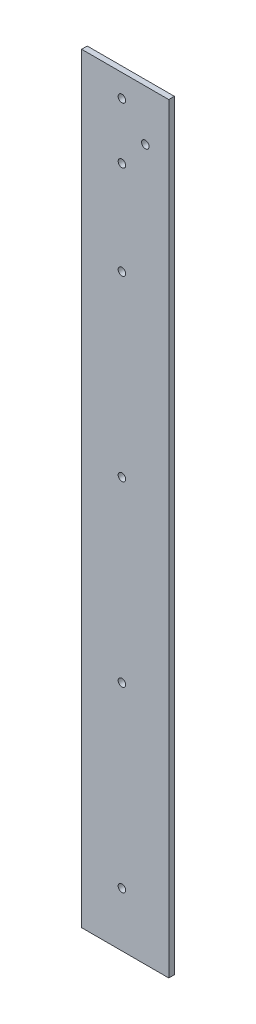
ISO-10303-21;
HEADER;
FILE_DESCRIPTION(('STEP AP214'),'2;1');
FILE_NAME('part.step','',(''),(''),'','','');
FILE_SCHEMA(('AUTOMOTIVE_DESIGN { 1 0 10303 214 1 1 1 1 }'));
ENDSEC;
DATA;
#1=APPLICATION_CONTEXT('core data for automotive mechanical design processes');
#2=APPLICATION_PROTOCOL_DEFINITION('international standard','automotive_design',2000,#1);
#3=PRODUCT_CONTEXT('',#1,'mechanical');
#4=PRODUCT('Part','Part','',(#3));
#5=PRODUCT_RELATED_PRODUCT_CATEGORY('part','',(#4));
#6=PRODUCT_DEFINITION_FORMATION('','',#4);
#7=PRODUCT_DEFINITION_CONTEXT('part definition',#1,'design');
#8=PRODUCT_DEFINITION('design','',#6,#7);
#9=PRODUCT_DEFINITION_SHAPE('','',#8);
#10=(LENGTH_UNIT() NAMED_UNIT(*) SI_UNIT(.MILLI.,.METRE.));
#11=(NAMED_UNIT(*) PLANE_ANGLE_UNIT() SI_UNIT($,.RADIAN.));
#12=(NAMED_UNIT(*) SI_UNIT($,.STERADIAN.) SOLID_ANGLE_UNIT());
#13=UNCERTAINTY_MEASURE_WITH_UNIT(LENGTH_MEASURE(1.E-05),#10,'distance_accuracy_value','');
#14=(GEOMETRIC_REPRESENTATION_CONTEXT(3) GLOBAL_UNCERTAINTY_ASSIGNED_CONTEXT((#13)) GLOBAL_UNIT_ASSIGNED_CONTEXT((#10,
#11,#12)) REPRESENTATION_CONTEXT('',''));
#15=CARTESIAN_POINT('',(0.,0.,0.));
#16=DIRECTION('',(0.,0.,1.));
#17=DIRECTION('',(1.,0.,0.));
#18=AXIS2_PLACEMENT_3D('',#15,#16,#17);
#19=CARTESIAN_POINT('',(0.,0.,3.));
#20=DIRECTION('',(0.,0.,1.));
#21=DIRECTION('',(1.,0.,0.));
#22=AXIS2_PLACEMENT_3D('',#19,#20,#21);
#23=PLANE('',#22);
#24=CARTESIAN_POINT('',(-1.19205738297437,-78.7210286915478,3.));
#25=DIRECTION('',(0.,0.,1.));
#26=DIRECTION('',(1.,0.,0.));
#27=AXIS2_PLACEMENT_3D('',#24,#25,#26);
#28=CIRCLE('',#27,2.0000000000209);
#29=CARTESIAN_POINT('',(0.807942617046531,-78.7210286915478,3.));
#30=VERTEX_POINT('',#29);
#31=EDGE_CURVE('E139',#30,#30,#28,.T.);
#32=ORIENTED_EDGE('',*,*,#31,.F.);
#33=EDGE_LOOP('',(#32));
#34=FACE_BOUND('',#33,.T.);
#35=CARTESIAN_POINT('',(-1.19205738297238,111.278971308452,3.));
#36=DIRECTION('',(0.,0.,1.));
#37=DIRECTION('',(1.,0.,0.));
#38=AXIS2_PLACEMENT_3D('',#35,#36,#37);
#39=CIRCLE('',#38,2.0000000000209);
#40=CARTESIAN_POINT('',(0.807942617048523,111.278971308452,3.));
#41=VERTEX_POINT('',#40);
#42=EDGE_CURVE('E127',#41,#41,#39,.T.);
#43=ORIENTED_EDGE('',*,*,#42,.F.);
#44=EDGE_LOOP('',(#43));
#45=FACE_BOUND('',#44,.T.);
#46=CARTESIAN_POINT('',(11.3079426170038,176.278971308488,3.));
#47=DIRECTION('',(0.,0.,1.));
#48=DIRECTION('',(1.,0.,0.));
#49=AXIS2_PLACEMENT_3D('',#46,#47,#48);
#50=CIRCLE('',#49,1.99999999998598);
#51=CARTESIAN_POINT('',(13.3079426169898,176.278971308488,3.));
#52=VERTEX_POINT('',#51);
#53=EDGE_CURVE('E115',#52,#52,#50,.T.);
#54=ORIENTED_EDGE('',*,*,#53,.F.);
#55=EDGE_LOOP('',(#54));
#56=FACE_BOUND('',#55,.T.);
#57=DIRECTION('',(0.,-1.,0.));
#58=VECTOR('',#57,1.);
#59=CARTESIAN_POINT('',(-22.692057382974,203.278971308515,3.));
#60=LINE('',#59,#58);
#61=CARTESIAN_POINT('',(-22.692057382974,203.278971308515,3.));
#62=VERTEX_POINT('',#61);
#63=CARTESIAN_POINT('',(-22.692057382974,-202.721028691489,3.));
#64=VERTEX_POINT('',#63);
#65=EDGE_CURVE('E85',#62,#64,#60,.T.);
#66=ORIENTED_EDGE('',*,*,#65,.T.);
#67=DIRECTION('',(1.,0.,0.));
#68=VECTOR('',#67,1.);
#69=CARTESIAN_POINT('',(-22.692057382974,-202.721028691489,3.));
#70=LINE('',#69,#68);
#71=CARTESIAN_POINT('',(23.8079426170267,-202.721028691489,3.));
#72=VERTEX_POINT('',#71);
#73=EDGE_CURVE('E80',#64,#72,#70,.T.);
#74=ORIENTED_EDGE('',*,*,#73,.T.);
#75=DIRECTION('',(0.,1.,0.));
#76=VECTOR('',#75,1.);
#77=CARTESIAN_POINT('',(23.8079426170267,203.278971308515,3.));
#78=LINE('',#77,#76);
#79=CARTESIAN_POINT('',(23.8079426170267,203.278971308515,3.));
#80=VERTEX_POINT('',#79);
#81=EDGE_CURVE('E83',#72,#80,#78,.T.);
#82=ORIENTED_EDGE('',*,*,#81,.T.);
#83=DIRECTION('',(-1.,0.,0.));
#84=VECTOR('',#83,1.);
#85=CARTESIAN_POINT('',(-22.692057382974,203.278971308515,3.));
#86=LINE('',#85,#84);
#87=EDGE_CURVE('E50',#80,#62,#86,.T.);
#88=ORIENTED_EDGE('',*,*,#87,.T.);
#89=EDGE_LOOP('',(#66,#74,#82,#88));
#90=FACE_BOUND('',#89,.T.);
#91=CARTESIAN_POINT('',(-1.19205738298598,191.278971308523,3.));
#92=DIRECTION('',(0.,0.,1.));
#93=DIRECTION('',(1.,0.,0.));
#94=AXIS2_PLACEMENT_3D('',#91,#92,#93);
#95=CIRCLE('',#94,1.99999999998372);
#96=CARTESIAN_POINT('',(0.807942616997736,191.278971308523,3.));
#97=VERTEX_POINT('',#96);
#98=EDGE_CURVE('E100',#97,#97,#95,.T.);
#99=ORIENTED_EDGE('',*,*,#98,.F.);
#100=EDGE_LOOP('',(#99));
#101=FACE_BOUND('',#100,.T.);
#102=CARTESIAN_POINT('',(-1.192057382986,161.278971308452,3.));
#103=DIRECTION('',(0.,0.,1.));
#104=DIRECTION('',(1.,0.,0.));
#105=AXIS2_PLACEMENT_3D('',#102,#103,#104);
#106=CIRCLE('',#105,2.00000000000463);
#107=CARTESIAN_POINT('',(0.807942617018633,161.278971308452,3.));
#108=VERTEX_POINT('',#107);
#109=EDGE_CURVE('E121',#108,#108,#106,.T.);
#110=ORIENTED_EDGE('',*,*,#109,.F.);
#111=EDGE_LOOP('',(#110));
#112=FACE_BOUND('',#111,.T.);
#113=CARTESIAN_POINT('',(-1.19205738297338,16.2789713084522,3.));
#114=DIRECTION('',(0.,0.,1.));
#115=DIRECTION('',(1.,0.,0.));
#116=AXIS2_PLACEMENT_3D('',#113,#114,#115);
#117=CIRCLE('',#116,2.0000000000209);
#118=CARTESIAN_POINT('',(0.807942617047528,16.2789713084522,3.));
#119=VERTEX_POINT('',#118);
#120=EDGE_CURVE('E133',#119,#119,#117,.T.);
#121=ORIENTED_EDGE('',*,*,#120,.F.);
#122=EDGE_LOOP('',(#121));
#123=FACE_BOUND('',#122,.T.);
#124=CARTESIAN_POINT('',(-1.19205738297537,-173.721028691548,3.));
#125=DIRECTION('',(0.,0.,1.));
#126=DIRECTION('',(1.,0.,0.));
#127=AXIS2_PLACEMENT_3D('',#124,#125,#126);
#128=CIRCLE('',#127,2.0000000000209);
#129=CARTESIAN_POINT('',(0.807942617045534,-173.721028691548,3.));
#130=VERTEX_POINT('',#129);
#131=EDGE_CURVE('E145',#130,#130,#128,.T.);
#132=ORIENTED_EDGE('',*,*,#131,.F.);
#133=EDGE_LOOP('',(#132));
#134=FACE_BOUND('',#133,.T.);
#135=ADVANCED_FACE('F33',(#34,#45,#56,#90,#101,#112,#123,#134),#23,.T.);
#136=CARTESIAN_POINT('',(0.,0.,0.));
#137=DIRECTION('',(0.,0.,1.));
#138=DIRECTION('',(1.,0.,0.));
#139=AXIS2_PLACEMENT_3D('',#136,#137,#138);
#140=PLANE('',#139);
#141=DIRECTION('',(0.,-1.,0.));
#142=VECTOR('',#141,1.);
#143=CARTESIAN_POINT('',(-22.692057382974,203.278971308515,0.));
#144=LINE('',#143,#142);
#145=CARTESIAN_POINT('',(-22.692057382974,203.278971308515,0.));
#146=VERTEX_POINT('',#145);
#147=CARTESIAN_POINT('',(-22.692057382974,-202.721028691489,0.));
#148=VERTEX_POINT('',#147);
#149=EDGE_CURVE('E97',#146,#148,#144,.T.);
#150=ORIENTED_EDGE('',*,*,#149,.F.);
#151=DIRECTION('',(-1.,0.,0.));
#152=VECTOR('',#151,1.);
#153=CARTESIAN_POINT('',(-22.692057382974,203.278971308515,0.));
#154=LINE('',#153,#152);
#155=CARTESIAN_POINT('',(23.8079426170267,203.278971308515,0.));
#156=VERTEX_POINT('',#155);
#157=EDGE_CURVE('E73',#156,#146,#154,.T.);
#158=ORIENTED_EDGE('',*,*,#157,.F.);
#159=DIRECTION('',(0.,1.,0.));
#160=VECTOR('',#159,1.);
#161=CARTESIAN_POINT('',(23.8079426170267,203.278971308515,0.));
#162=LINE('',#161,#160);
#163=CARTESIAN_POINT('',(23.8079426170267,-202.721028691489,0.));
#164=VERTEX_POINT('',#163);
#165=EDGE_CURVE('E67',#164,#156,#162,.T.);
#166=ORIENTED_EDGE('',*,*,#165,.F.);
#167=DIRECTION('',(1.,0.,0.));
#168=VECTOR('',#167,1.);
#169=CARTESIAN_POINT('',(-22.692057382974,-202.721028691489,0.));
#170=LINE('',#169,#168);
#171=EDGE_CURVE('E89',#148,#164,#170,.T.);
#172=ORIENTED_EDGE('',*,*,#171,.F.);
#173=EDGE_LOOP('',(#150,#158,#166,#172));
#174=FACE_BOUND('',#173,.T.);
#175=CARTESIAN_POINT('',(-1.19205738298598,191.278971308523,0.));
#176=DIRECTION('',(0.,0.,1.));
#177=DIRECTION('',(1.,0.,0.));
#178=AXIS2_PLACEMENT_3D('',#175,#176,#177);
#179=CIRCLE('',#178,1.99999999998372);
#180=CARTESIAN_POINT('',(0.807942616997736,191.278971308523,0.));
#181=VERTEX_POINT('',#180);
#182=EDGE_CURVE('E112',#181,#181,#179,.T.);
#183=ORIENTED_EDGE('',*,*,#182,.T.);
#184=EDGE_LOOP('',(#183));
#185=FACE_BOUND('',#184,.T.);
#186=CARTESIAN_POINT('',(11.3079426170038,176.278971308488,0.));
#187=DIRECTION('',(0.,0.,1.));
#188=DIRECTION('',(1.,0.,0.));
#189=AXIS2_PLACEMENT_3D('',#186,#187,#188);
#190=CIRCLE('',#189,1.99999999998598);
#191=CARTESIAN_POINT('',(13.3079426169898,176.278971308488,0.));
#192=VERTEX_POINT('',#191);
#193=EDGE_CURVE('E118',#192,#192,#190,.T.);
#194=ORIENTED_EDGE('',*,*,#193,.T.);
#195=EDGE_LOOP('',(#194));
#196=FACE_BOUND('',#195,.T.);
#197=CARTESIAN_POINT('',(-1.192057382986,161.278971308452,0.));
#198=DIRECTION('',(0.,0.,1.));
#199=DIRECTION('',(1.,0.,0.));
#200=AXIS2_PLACEMENT_3D('',#197,#198,#199);
#201=CIRCLE('',#200,2.00000000000463);
#202=CARTESIAN_POINT('',(0.807942617018633,161.278971308452,0.));
#203=VERTEX_POINT('',#202);
#204=EDGE_CURVE('E124',#203,#203,#201,.T.);
#205=ORIENTED_EDGE('',*,*,#204,.T.);
#206=EDGE_LOOP('',(#205));
#207=FACE_BOUND('',#206,.T.);
#208=CARTESIAN_POINT('',(-1.19205738297238,111.278971308452,0.));
#209=DIRECTION('',(0.,0.,1.));
#210=DIRECTION('',(1.,0.,0.));
#211=AXIS2_PLACEMENT_3D('',#208,#209,#210);
#212=CIRCLE('',#211,2.0000000000209);
#213=CARTESIAN_POINT('',(0.807942617048523,111.278971308452,0.));
#214=VERTEX_POINT('',#213);
#215=EDGE_CURVE('E130',#214,#214,#212,.T.);
#216=ORIENTED_EDGE('',*,*,#215,.T.);
#217=EDGE_LOOP('',(#216));
#218=FACE_BOUND('',#217,.T.);
#219=CARTESIAN_POINT('',(-1.19205738297338,16.2789713084522,0.));
#220=DIRECTION('',(0.,0.,1.));
#221=DIRECTION('',(1.,0.,0.));
#222=AXIS2_PLACEMENT_3D('',#219,#220,#221);
#223=CIRCLE('',#222,2.0000000000209);
#224=CARTESIAN_POINT('',(0.807942617047528,16.2789713084522,0.));
#225=VERTEX_POINT('',#224);
#226=EDGE_CURVE('E136',#225,#225,#223,.T.);
#227=ORIENTED_EDGE('',*,*,#226,.T.);
#228=EDGE_LOOP('',(#227));
#229=FACE_BOUND('',#228,.T.);
#230=CARTESIAN_POINT('',(-1.19205738297437,-78.7210286915478,0.));
#231=DIRECTION('',(0.,0.,1.));
#232=DIRECTION('',(1.,0.,0.));
#233=AXIS2_PLACEMENT_3D('',#230,#231,#232);
#234=CIRCLE('',#233,2.0000000000209);
#235=CARTESIAN_POINT('',(0.807942617046531,-78.7210286915478,0.));
#236=VERTEX_POINT('',#235);
#237=EDGE_CURVE('E142',#236,#236,#234,.T.);
#238=ORIENTED_EDGE('',*,*,#237,.T.);
#239=EDGE_LOOP('',(#238));
#240=FACE_BOUND('',#239,.T.);
#241=CARTESIAN_POINT('',(-1.19205738297537,-173.721028691548,0.));
#242=DIRECTION('',(0.,0.,1.));
#243=DIRECTION('',(1.,0.,0.));
#244=AXIS2_PLACEMENT_3D('',#241,#242,#243);
#245=CIRCLE('',#244,2.0000000000209);
#246=CARTESIAN_POINT('',(0.807942617045534,-173.721028691548,0.));
#247=VERTEX_POINT('',#246);
#248=EDGE_CURVE('E148',#247,#247,#245,.T.);
#249=ORIENTED_EDGE('',*,*,#248,.T.);
#250=EDGE_LOOP('',(#249));
#251=FACE_BOUND('',#250,.T.);
#252=ADVANCED_FACE('F108',(#174,#185,#196,#207,#218,#229,#240,#251),#140,.F.);
#253=CARTESIAN_POINT('',(-22.692057382974,203.278971308515,3.));
#254=DIRECTION('',(1.,0.,0.));
#255=DIRECTION('',(0.,0.,-1.));
#256=AXIS2_PLACEMENT_3D('',#253,#254,#255);
#257=PLANE('',#256);
#258=ORIENTED_EDGE('',*,*,#149,.T.);
#259=DIRECTION('',(0.,0.,-1.));
#260=VECTOR('',#259,1.);
#261=CARTESIAN_POINT('',(-22.692057382974,-202.721028691489,3.));
#262=LINE('',#261,#260);
#263=EDGE_CURVE('E11',#64,#148,#262,.T.);
#264=ORIENTED_EDGE('',*,*,#263,.F.);
#265=ORIENTED_EDGE('',*,*,#65,.F.);
#266=DIRECTION('',(0.,0.,-1.));
#267=VECTOR('',#266,1.);
#268=CARTESIAN_POINT('',(-22.692057382974,203.278971308515,3.));
#269=LINE('',#268,#267);
#270=EDGE_CURVE('E93',#62,#146,#269,.T.);
#271=ORIENTED_EDGE('',*,*,#270,.T.);
#272=EDGE_LOOP('',(#258,#264,#265,#271));
#273=FACE_BOUND('',#272,.T.);
#274=ADVANCED_FACE('F35',(#273),#257,.F.);
#275=CARTESIAN_POINT('',(-22.692057382974,-202.721028691489,3.));
#276=DIRECTION('',(0.,1.,0.));
#277=DIRECTION('',(0.,0.,1.));
#278=AXIS2_PLACEMENT_3D('',#275,#276,#277);
#279=PLANE('',#278);
#280=ORIENTED_EDGE('',*,*,#171,.T.);
#281=DIRECTION('',(0.,0.,-1.));
#282=VECTOR('',#281,1.);
#283=CARTESIAN_POINT('',(23.8079426170267,-202.721028691489,3.));
#284=LINE('',#283,#282);
#285=EDGE_CURVE('E42',#72,#164,#284,.T.);
#286=ORIENTED_EDGE('',*,*,#285,.F.);
#287=ORIENTED_EDGE('',*,*,#73,.F.);
#288=ORIENTED_EDGE('',*,*,#263,.T.);
#289=EDGE_LOOP('',(#280,#286,#287,#288));
#290=FACE_BOUND('',#289,.T.);
#291=ADVANCED_FACE('F88',(#290),#279,.F.);
#292=CARTESIAN_POINT('',(23.8079426170267,203.278971308515,3.));
#293=DIRECTION('',(-1.,0.,0.));
#294=DIRECTION('',(0.,-1.,0.));
#295=AXIS2_PLACEMENT_3D('',#292,#293,#294);
#296=PLANE('',#295);
#297=ORIENTED_EDGE('',*,*,#165,.T.);
#298=DIRECTION('',(0.,0.,-1.));
#299=VECTOR('',#298,1.);
#300=CARTESIAN_POINT('',(23.8079426170267,203.278971308515,3.));
#301=LINE('',#300,#299);
#302=EDGE_CURVE('E90',#80,#156,#301,.T.);
#303=ORIENTED_EDGE('',*,*,#302,.F.);
#304=ORIENTED_EDGE('',*,*,#81,.F.);
#305=ORIENTED_EDGE('',*,*,#285,.T.);
#306=EDGE_LOOP('',(#297,#303,#304,#305));
#307=FACE_BOUND('',#306,.T.);
#308=ADVANCED_FACE('F91',(#307),#296,.F.);
#309=CARTESIAN_POINT('',(-22.692057382974,203.278971308515,3.));
#310=DIRECTION('',(0.,-1.,0.));
#311=DIRECTION('',(0.,0.,-1.));
#312=AXIS2_PLACEMENT_3D('',#309,#310,#311);
#313=PLANE('',#312);
#314=ORIENTED_EDGE('',*,*,#157,.T.);
#315=ORIENTED_EDGE('',*,*,#270,.F.);
#316=ORIENTED_EDGE('',*,*,#87,.F.);
#317=ORIENTED_EDGE('',*,*,#302,.T.);
#318=EDGE_LOOP('',(#314,#315,#316,#317));
#319=FACE_BOUND('',#318,.T.);
#320=ADVANCED_FACE('F105',(#319),#313,.F.);
#321=CARTESIAN_POINT('',(-1.19205738298598,191.278971308523,3.));
#322=DIRECTION('',(0.,0.,-1.));
#323=DIRECTION('',(-1.,0.,0.));
#324=AXIS2_PLACEMENT_3D('',#321,#322,#323);
#325=CYLINDRICAL_SURFACE('',#324,1.99999999998372);
#326=ORIENTED_EDGE('',*,*,#98,.T.);
#327=EDGE_LOOP('',(#326));
#328=FACE_BOUND('',#327,.T.);
#329=ORIENTED_EDGE('',*,*,#182,.F.);
#330=EDGE_LOOP('',(#329));
#331=FACE_BOUND('',#330,.T.);
#332=ADVANCED_FACE('F167',(#328,#331),#325,.F.);
#333=CARTESIAN_POINT('',(11.3079426170038,176.278971308488,3.));
#334=DIRECTION('',(0.,0.,-1.));
#335=DIRECTION('',(-1.,0.,0.));
#336=AXIS2_PLACEMENT_3D('',#333,#334,#335);
#337=CYLINDRICAL_SURFACE('',#336,1.99999999998598);
#338=ORIENTED_EDGE('',*,*,#53,.T.);
#339=EDGE_LOOP('',(#338));
#340=FACE_BOUND('',#339,.T.);
#341=ORIENTED_EDGE('',*,*,#193,.F.);
#342=EDGE_LOOP('',(#341));
#343=FACE_BOUND('',#342,.T.);
#344=ADVANCED_FACE('F213',(#340,#343),#337,.F.);
#345=CARTESIAN_POINT('',(-1.192057382986,161.278971308452,3.));
#346=DIRECTION('',(0.,0.,-1.));
#347=DIRECTION('',(-1.,0.,0.));
#348=AXIS2_PLACEMENT_3D('',#345,#346,#347);
#349=CYLINDRICAL_SURFACE('',#348,2.00000000000463);
#350=ORIENTED_EDGE('',*,*,#109,.T.);
#351=EDGE_LOOP('',(#350));
#352=FACE_BOUND('',#351,.T.);
#353=ORIENTED_EDGE('',*,*,#204,.F.);
#354=EDGE_LOOP('',(#353));
#355=FACE_BOUND('',#354,.T.);
#356=ADVANCED_FACE('F221',(#352,#355),#349,.F.);
#357=CARTESIAN_POINT('',(-1.19205738297238,111.278971308452,3.));
#358=DIRECTION('',(0.,0.,-1.));
#359=DIRECTION('',(-1.,0.,0.));
#360=AXIS2_PLACEMENT_3D('',#357,#358,#359);
#361=CYLINDRICAL_SURFACE('',#360,2.0000000000209);
#362=ORIENTED_EDGE('',*,*,#42,.T.);
#363=EDGE_LOOP('',(#362));
#364=FACE_BOUND('',#363,.T.);
#365=ORIENTED_EDGE('',*,*,#215,.F.);
#366=EDGE_LOOP('',(#365));
#367=FACE_BOUND('',#366,.T.);
#368=ADVANCED_FACE('F229',(#364,#367),#361,.F.);
#369=CARTESIAN_POINT('',(-1.19205738297338,16.2789713084522,3.));
#370=DIRECTION('',(0.,0.,-1.));
#371=DIRECTION('',(-1.,0.,0.));
#372=AXIS2_PLACEMENT_3D('',#369,#370,#371);
#373=CYLINDRICAL_SURFACE('',#372,2.0000000000209);
#374=ORIENTED_EDGE('',*,*,#120,.T.);
#375=EDGE_LOOP('',(#374));
#376=FACE_BOUND('',#375,.T.);
#377=ORIENTED_EDGE('',*,*,#226,.F.);
#378=EDGE_LOOP('',(#377));
#379=FACE_BOUND('',#378,.T.);
#380=ADVANCED_FACE('F238',(#376,#379),#373,.F.);
#381=CARTESIAN_POINT('',(-1.19205738297437,-78.7210286915478,3.));
#382=DIRECTION('',(0.,0.,-1.));
#383=DIRECTION('',(-1.,0.,0.));
#384=AXIS2_PLACEMENT_3D('',#381,#382,#383);
#385=CYLINDRICAL_SURFACE('',#384,2.0000000000209);
#386=ORIENTED_EDGE('',*,*,#31,.T.);
#387=EDGE_LOOP('',(#386));
#388=FACE_BOUND('',#387,.T.);
#389=ORIENTED_EDGE('',*,*,#237,.F.);
#390=EDGE_LOOP('',(#389));
#391=FACE_BOUND('',#390,.T.);
#392=ADVANCED_FACE('F247',(#388,#391),#385,.F.);
#393=CARTESIAN_POINT('',(-1.19205738297537,-173.721028691548,3.));
#394=DIRECTION('',(0.,0.,-1.));
#395=DIRECTION('',(-1.,0.,0.));
#396=AXIS2_PLACEMENT_3D('',#393,#394,#395);
#397=CYLINDRICAL_SURFACE('',#396,2.0000000000209);
#398=ORIENTED_EDGE('',*,*,#131,.T.);
#399=EDGE_LOOP('',(#398));
#400=FACE_BOUND('',#399,.T.);
#401=ORIENTED_EDGE('',*,*,#248,.F.);
#402=EDGE_LOOP('',(#401));
#403=FACE_BOUND('',#402,.T.);
#404=ADVANCED_FACE('F154',(#400,#403),#397,.F.);
#405=CLOSED_SHELL('',(#135,#252,#274,#291,#308,#320,#332,#344,#356,#368,#380,#392,#404));
#406=MANIFOLD_SOLID_BREP('B2',#405);
#407=ADVANCED_BREP_SHAPE_REPRESENTATION('',(#18,#406),#14);
#408=SHAPE_DEFINITION_REPRESENTATION(#9,#407);
ENDSEC;
END-ISO-10303-21;
